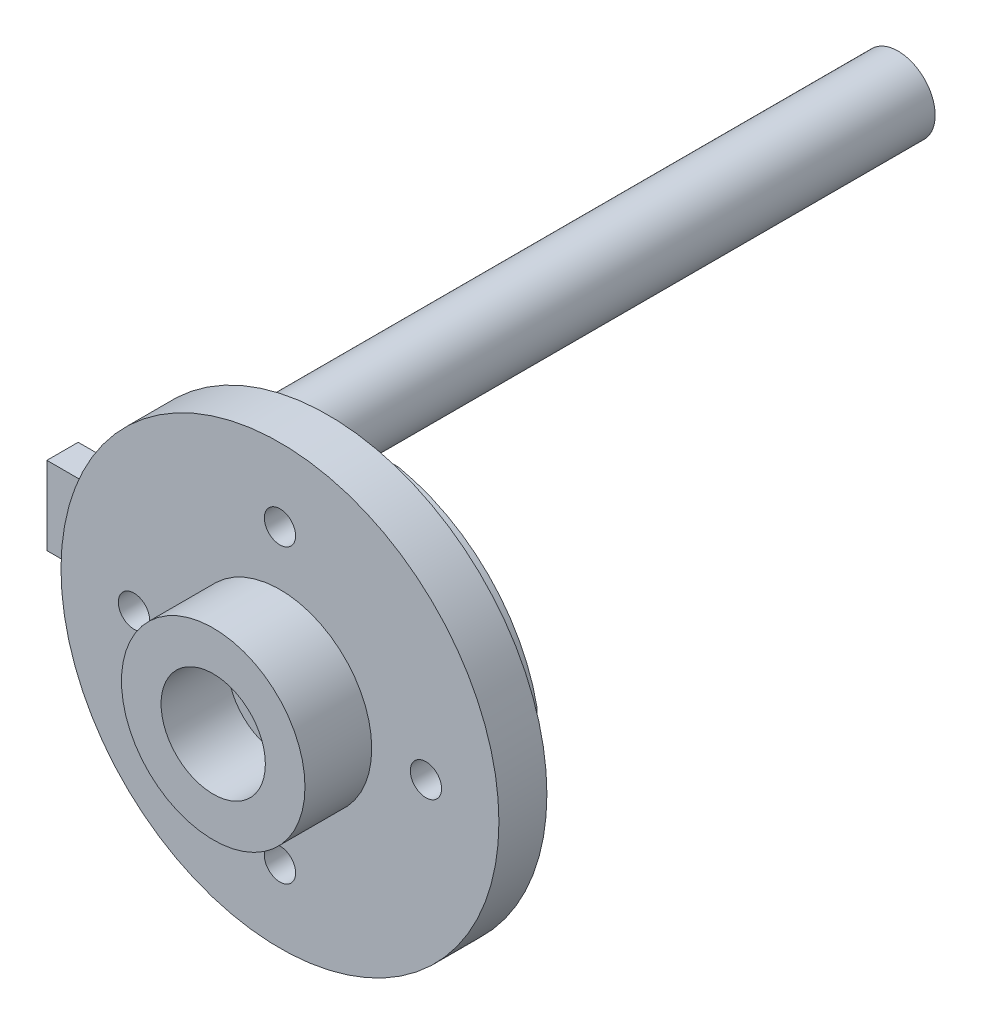
ISO-10303-21;
HEADER;
FILE_DESCRIPTION(('STEP AP214'),'2;1');
FILE_NAME('part.step','',(''),(''),'','','');
FILE_SCHEMA(('AUTOMOTIVE_DESIGN { 1 0 10303 214 1 1 1 1 }'));
ENDSEC;
DATA;
#1=APPLICATION_CONTEXT('core data for automotive mechanical design processes');
#2=APPLICATION_PROTOCOL_DEFINITION('international standard','automotive_design',2000,#1);
#3=PRODUCT_CONTEXT('',#1,'mechanical');
#4=PRODUCT('Part','Part','',(#3));
#5=PRODUCT_RELATED_PRODUCT_CATEGORY('part','',(#4));
#6=PRODUCT_DEFINITION_FORMATION('','',#4);
#7=PRODUCT_DEFINITION_CONTEXT('part definition',#1,'design');
#8=PRODUCT_DEFINITION('design','',#6,#7);
#9=PRODUCT_DEFINITION_SHAPE('','',#8);
#10=(LENGTH_UNIT() NAMED_UNIT(*) SI_UNIT(.MILLI.,.METRE.));
#11=(NAMED_UNIT(*) PLANE_ANGLE_UNIT() SI_UNIT($,.RADIAN.));
#12=(NAMED_UNIT(*) SI_UNIT($,.STERADIAN.) SOLID_ANGLE_UNIT());
#13=UNCERTAINTY_MEASURE_WITH_UNIT(LENGTH_MEASURE(1.E-05),#10,'distance_accuracy_value','');
#14=(GEOMETRIC_REPRESENTATION_CONTEXT(3) GLOBAL_UNCERTAINTY_ASSIGNED_CONTEXT((#13)) GLOBAL_UNIT_ASSIGNED_CONTEXT((#10,
#11,#12)) REPRESENTATION_CONTEXT('',''));
#15=CARTESIAN_POINT('',(0.,0.,0.));
#16=DIRECTION('',(0.,0.,1.));
#17=DIRECTION('',(1.,0.,0.));
#18=AXIS2_PLACEMENT_3D('',#15,#16,#17);
#19=CARTESIAN_POINT('',(0.,0.,0.));
#20=DIRECTION('',(0.,0.,1.));
#21=DIRECTION('',(1.,0.,0.));
#22=AXIS2_PLACEMENT_3D('',#19,#20,#21);
#23=PLANE('',#22);
#24=DIRECTION('',(-1.,0.,0.));
#25=VECTOR('',#24,1.);
#26=CARTESIAN_POINT('',(0.,8.5241,0.));
#27=LINE('',#26,#25);
#28=CARTESIAN_POINT('',(1.875,8.5241,0.));
#29=VERTEX_POINT('',#28);
#30=CARTESIAN_POINT('',(-1.875,8.5241,0.));
#31=VERTEX_POINT('',#30);
#32=EDGE_CURVE('E58',#29,#31,#27,.T.);
#33=ORIENTED_EDGE('',*,*,#32,.T.);
#34=CARTESIAN_POINT('',(-0.171875815797131,0.171875815797131,0.));
#35=DIRECTION('',(0.,0.,-1.));
#36=DIRECTION('',(-1.,0.,0.));
#37=AXIS2_PLACEMENT_3D('',#34,#35,#36);
#38=CIRCLE('',#37,8.5241);
#39=CARTESIAN_POINT('',(-8.5241,1.875,0.));
#40=VERTEX_POINT('',#39);
#41=EDGE_CURVE('E172',#31,#40,#38,.F.);
#42=ORIENTED_EDGE('',*,*,#41,.T.);
#43=DIRECTION('',(-1.,0.,0.));
#44=VECTOR('',#43,1.);
#45=CARTESIAN_POINT('',(0.,1.875,0.));
#46=LINE('',#45,#44);
#47=CARTESIAN_POINT('',(-10.3312329854669,1.875,0.));
#48=VERTEX_POINT('',#47);
#49=EDGE_CURVE('E147',#40,#48,#46,.T.);
#50=ORIENTED_EDGE('',*,*,#49,.T.);
#51=CARTESIAN_POINT('',(0.,0.,0.));
#52=DIRECTION('',(0.,0.,1.));
#53=DIRECTION('',(1.,0.,0.));
#54=AXIS2_PLACEMENT_3D('',#51,#52,#53);
#55=CIRCLE('',#54,10.5);
#56=CARTESIAN_POINT('',(-10.3312329854669,-1.875,0.));
#57=VERTEX_POINT('',#56);
#58=EDGE_CURVE('E300',#57,#48,#55,.T.);
#59=ORIENTED_EDGE('',*,*,#58,.F.);
#60=DIRECTION('',(-1.,0.,0.));
#61=VECTOR('',#60,1.);
#62=CARTESIAN_POINT('',(0.,-1.875,0.));
#63=LINE('',#62,#61);
#64=CARTESIAN_POINT('',(-8.5241,-1.875,0.));
#65=VERTEX_POINT('',#64);
#66=EDGE_CURVE('E222',#65,#57,#63,.T.);
#67=ORIENTED_EDGE('',*,*,#66,.F.);
#68=CARTESIAN_POINT('',(-0.171875815797131,-0.171875815797131,0.));
#69=DIRECTION('',(0.,0.,-1.));
#70=DIRECTION('',(-1.,0.,0.));
#71=AXIS2_PLACEMENT_3D('',#68,#69,#70);
#72=CIRCLE('',#71,8.5241);
#73=CARTESIAN_POINT('',(-1.875,-8.5241,0.));
#74=VERTEX_POINT('',#73);
#75=EDGE_CURVE('E185',#65,#74,#72,.F.);
#76=ORIENTED_EDGE('',*,*,#75,.T.);
#77=DIRECTION('',(-1.,0.,0.));
#78=VECTOR('',#77,1.);
#79=CARTESIAN_POINT('',(0.,-8.5241,0.));
#80=LINE('',#79,#78);
#81=CARTESIAN_POINT('',(1.875,-8.5241,0.));
#82=VERTEX_POINT('',#81);
#83=EDGE_CURVE('E200',#82,#74,#80,.T.);
#84=ORIENTED_EDGE('',*,*,#83,.F.);
#85=CARTESIAN_POINT('',(0.171932036922245,-0.171864351795491,0.));
#86=DIRECTION('',(0.,0.,-1.));
#87=DIRECTION('',(-1.,0.,0.));
#88=AXIS2_PLACEMENT_3D('',#85,#86,#87);
#89=CIRCLE('',#88,8.5241);
#90=CARTESIAN_POINT('',(8.52415388346195,-1.875,0.));
#91=VERTEX_POINT('',#90);
#92=EDGE_CURVE('E151',#82,#91,#89,.F.);
#93=ORIENTED_EDGE('',*,*,#92,.T.);
#94=DIRECTION('',(0.,-1.,0.));
#95=VECTOR('',#94,1.);
#96=CARTESIAN_POINT('',(8.52415388346195,0.,0.));
#97=LINE('',#96,#95);
#98=CARTESIAN_POINT('',(8.52415388346195,1.875,0.));
#99=VERTEX_POINT('',#98);
#100=EDGE_CURVE('E249',#99,#91,#97,.T.);
#101=ORIENTED_EDGE('',*,*,#100,.F.);
#102=CARTESIAN_POINT('',(0.171932036922245,0.171864351795491,0.));
#103=DIRECTION('',(0.,0.,-1.));
#104=DIRECTION('',(-1.,0.,0.));
#105=AXIS2_PLACEMENT_3D('',#102,#103,#104);
#106=CIRCLE('',#105,8.5241);
#107=EDGE_CURVE('E63',#29,#99,#106,.T.);
#108=ORIENTED_EDGE('',*,*,#107,.F.);
#109=EDGE_LOOP('',(#33,#42,#50,#59,#67,#76,#84,#93,#101,#108));
#110=FACE_BOUND('',#109,.T.);
#111=ADVANCED_FACE('F41',(#110),#23,.F.);
#112=CARTESIAN_POINT('',(0.,0.,2.3));
#113=DIRECTION('',(0.,0.,1.));
#114=DIRECTION('',(1.,0.,0.));
#115=AXIS2_PLACEMENT_3D('',#112,#113,#114);
#116=PLANE('',#115);
#117=CARTESIAN_POINT('',(0.,0.,2.3));
#118=DIRECTION('',(0.,0.,1.));
#119=DIRECTION('',(1.,0.,0.));
#120=AXIS2_PLACEMENT_3D('',#117,#118,#119);
#121=CIRCLE('',#120,1.5);
#122=CARTESIAN_POINT('',(1.5,0.,2.3));
#123=VERTEX_POINT('',#122);
#124=EDGE_CURVE('E285',#123,#123,#121,.T.);
#125=ORIENTED_EDGE('',*,*,#124,.F.);
#126=EDGE_LOOP('',(#125));
#127=FACE_BOUND('',#126,.T.);
#128=CARTESIAN_POINT('',(0.,0.,2.3));
#129=DIRECTION('',(0.,0.,1.));
#130=DIRECTION('',(1.,0.,0.));
#131=AXIS2_PLACEMENT_3D('',#128,#129,#130);
#132=CIRCLE('',#131,2.5);
#133=CARTESIAN_POINT('',(2.5,0.,2.3));
#134=VERTEX_POINT('',#133);
#135=EDGE_CURVE('E45',#134,#134,#132,.F.);
#136=ORIENTED_EDGE('',*,*,#135,.F.);
#137=EDGE_LOOP('',(#136));
#138=FACE_BOUND('',#137,.T.);
#139=ADVANCED_FACE('F339',(#127,#138),#116,.T.);
#140=CARTESIAN_POINT('',(0.,0.,2.3));
#141=DIRECTION('',(0.,0.,-1.));
#142=DIRECTION('',(-1.,0.,0.));
#143=AXIS2_PLACEMENT_3D('',#140,#141,#142);
#144=CYLINDRICAL_SURFACE('',#143,10.5);
#145=CARTESIAN_POINT('',(0.,0.,2.3));
#146=DIRECTION('',(0.,0.,1.));
#147=DIRECTION('',(1.,0.,0.));
#148=AXIS2_PLACEMENT_3D('',#145,#146,#147);
#149=CIRCLE('',#148,10.5);
#150=CARTESIAN_POINT('',(10.5,0.,2.3));
#151=VERTEX_POINT('',#150);
#152=EDGE_CURVE('E301',#151,#151,#149,.T.);
#153=ORIENTED_EDGE('',*,*,#152,.F.);
#154=EDGE_LOOP('',(#153));
#155=FACE_BOUND('',#154,.T.);
#156=EDGE_CURVE('E304',#48,#57,#55,.T.);
#157=ORIENTED_EDGE('',*,*,#156,.T.);
#158=ORIENTED_EDGE('',*,*,#58,.T.);
#159=EDGE_LOOP('',(#157,#158));
#160=FACE_BOUND('',#159,.T.);
#161=ADVANCED_FACE('F43',(#155,#160),#144,.T.);
#162=CARTESIAN_POINT('',(0.,0.,2.3));
#163=DIRECTION('',(0.,0.,1.));
#164=DIRECTION('',(1.,0.,0.));
#165=AXIS2_PLACEMENT_3D('',#162,#163,#164);
#166=CIRCLE('',#165,4.4);
#167=CARTESIAN_POINT('',(4.4,0.,2.3));
#168=VERTEX_POINT('',#167);
#169=EDGE_CURVE('E272',#168,#168,#166,.T.);
#170=ORIENTED_EDGE('',*,*,#169,.F.);
#171=EDGE_LOOP('',(#170));
#172=FACE_BOUND('',#171,.T.);
#173=CARTESIAN_POINT('',(-7.,0.,2.3));
#174=DIRECTION('',(0.,0.,1.));
#175=DIRECTION('',(0.,1.,0.));
#176=AXIS2_PLACEMENT_3D('',#173,#174,#175);
#177=CIRCLE('',#176,0.75);
#178=CARTESIAN_POINT('',(-7.,0.749999999999976,2.3));
#179=VERTEX_POINT('',#178);
#180=EDGE_CURVE('E281',#179,#179,#177,.T.);
#181=ORIENTED_EDGE('',*,*,#180,.F.);
#182=EDGE_LOOP('',(#181));
#183=FACE_BOUND('',#182,.T.);
#184=CARTESIAN_POINT('',(0.,-7.,2.3));
#185=DIRECTION('',(0.,0.,1.));
#186=DIRECTION('',(-1.,0.,0.));
#187=AXIS2_PLACEMENT_3D('',#184,#185,#186);
#188=CIRCLE('',#187,0.75);
#189=CARTESIAN_POINT('',(-0.75,-7.,2.3));
#190=VERTEX_POINT('',#189);
#191=EDGE_CURVE('E286',#190,#190,#188,.T.);
#192=ORIENTED_EDGE('',*,*,#191,.F.);
#193=EDGE_LOOP('',(#192));
#194=FACE_BOUND('',#193,.T.);
#195=CARTESIAN_POINT('',(7.,0.,2.3));
#196=DIRECTION('',(0.,0.,1.));
#197=DIRECTION('',(0.,-1.,0.));
#198=AXIS2_PLACEMENT_3D('',#195,#196,#197);
#199=CIRCLE('',#198,0.75);
#200=CARTESIAN_POINT('',(7.00000000000001,-0.749999999999927,2.3));
#201=VERTEX_POINT('',#200);
#202=EDGE_CURVE('E277',#201,#201,#199,.T.);
#203=ORIENTED_EDGE('',*,*,#202,.F.);
#204=EDGE_LOOP('',(#203));
#205=FACE_BOUND('',#204,.T.);
#206=CARTESIAN_POINT('',(0.,7.,2.3));
#207=DIRECTION('',(0.,0.,1.));
#208=DIRECTION('',(1.,0.,0.));
#209=AXIS2_PLACEMENT_3D('',#206,#207,#208);
#210=CIRCLE('',#209,0.75);
#211=CARTESIAN_POINT('',(0.75,7.,2.3));
#212=VERTEX_POINT('',#211);
#213=EDGE_CURVE('E296',#212,#212,#210,.T.);
#214=ORIENTED_EDGE('',*,*,#213,.F.);
#215=EDGE_LOOP('',(#214));
#216=FACE_BOUND('',#215,.T.);
#217=ORIENTED_EDGE('',*,*,#152,.T.);
#218=EDGE_LOOP('',(#217));
#219=FACE_BOUND('',#218,.T.);
#220=ADVANCED_FACE('F347',(#172,#183,#194,#205,#216,#219),#116,.T.);
#221=CARTESIAN_POINT('',(0.,7.,0.));
#222=DIRECTION('',(0.,0.,1.));
#223=DIRECTION('',(1.,0.,0.));
#224=AXIS2_PLACEMENT_3D('',#221,#222,#223);
#225=CYLINDRICAL_SURFACE('',#224,0.75);
#226=ORIENTED_EDGE('',*,*,#213,.T.);
#227=EDGE_LOOP('',(#226));
#228=FACE_BOUND('',#227,.T.);
#229=CARTESIAN_POINT('',(0.,7.,-1.5));
#230=DIRECTION('',(0.,0.,-1.));
#231=DIRECTION('',(-1.,0.,0.));
#232=AXIS2_PLACEMENT_3D('',#229,#230,#231);
#233=CIRCLE('',#232,0.75);
#234=CARTESIAN_POINT('',(-0.75,7.,-1.5));
#235=VERTEX_POINT('',#234);
#236=EDGE_CURVE('E167',#235,#235,#233,.F.);
#237=ORIENTED_EDGE('',*,*,#236,.F.);
#238=EDGE_LOOP('',(#237));
#239=FACE_BOUND('',#238,.T.);
#240=ADVANCED_FACE('F350',(#228,#239),#225,.F.);
#241=CARTESIAN_POINT('',(0.,0.,0.));
#242=DIRECTION('',(0.,0.,1.));
#243=DIRECTION('',(1.,0.,0.));
#244=AXIS2_PLACEMENT_3D('',#241,#242,#243);
#245=CYLINDRICAL_SURFACE('',#244,1.5);
#246=ORIENTED_EDGE('',*,*,#124,.T.);
#247=EDGE_LOOP('',(#246));
#248=FACE_BOUND('',#247,.T.);
#249=CARTESIAN_POINT('',(0.,0.,-1.5));
#250=DIRECTION('',(0.,0.,-1.));
#251=DIRECTION('',(-1.,0.,0.));
#252=AXIS2_PLACEMENT_3D('',#249,#250,#251);
#253=CIRCLE('',#252,1.5);
#254=CARTESIAN_POINT('',(-1.5,0.,-1.5));
#255=VERTEX_POINT('',#254);
#256=EDGE_CURVE('E238',#255,#255,#253,.F.);
#257=ORIENTED_EDGE('',*,*,#256,.F.);
#258=EDGE_LOOP('',(#257));
#259=FACE_BOUND('',#258,.T.);
#260=ADVANCED_FACE('F354',(#248,#259),#245,.F.);
#261=CARTESIAN_POINT('',(7.,0.,0.));
#262=DIRECTION('',(0.,0.,1.));
#263=DIRECTION('',(1.,0.,0.));
#264=AXIS2_PLACEMENT_3D('',#261,#262,#263);
#265=CYLINDRICAL_SURFACE('',#264,0.75);
#266=ORIENTED_EDGE('',*,*,#202,.T.);
#267=EDGE_LOOP('',(#266));
#268=FACE_BOUND('',#267,.T.);
#269=CARTESIAN_POINT('',(7.,0.,-1.5));
#270=DIRECTION('',(0.,0.,-1.));
#271=DIRECTION('',(-1.,0.,0.));
#272=AXIS2_PLACEMENT_3D('',#269,#270,#271);
#273=CIRCLE('',#272,0.75);
#274=CARTESIAN_POINT('',(6.25,0.,-1.5));
#275=VERTEX_POINT('',#274);
#276=EDGE_CURVE('E234',#275,#275,#273,.F.);
#277=ORIENTED_EDGE('',*,*,#276,.F.);
#278=EDGE_LOOP('',(#277));
#279=FACE_BOUND('',#278,.T.);
#280=ADVANCED_FACE('F358',(#268,#279),#265,.F.);
#281=CARTESIAN_POINT('',(0.,-7.,0.));
#282=DIRECTION('',(0.,0.,1.));
#283=DIRECTION('',(1.,0.,0.));
#284=AXIS2_PLACEMENT_3D('',#281,#282,#283);
#285=CYLINDRICAL_SURFACE('',#284,0.75);
#286=ORIENTED_EDGE('',*,*,#191,.T.);
#287=EDGE_LOOP('',(#286));
#288=FACE_BOUND('',#287,.T.);
#289=CARTESIAN_POINT('',(0.,-7.,-1.5));
#290=DIRECTION('',(0.,0.,-1.));
#291=DIRECTION('',(-1.,0.,0.));
#292=AXIS2_PLACEMENT_3D('',#289,#290,#291);
#293=CIRCLE('',#292,0.75);
#294=CARTESIAN_POINT('',(-0.75,-7.,-1.5));
#295=VERTEX_POINT('',#294);
#296=EDGE_CURVE('E192',#295,#295,#293,.F.);
#297=ORIENTED_EDGE('',*,*,#296,.F.);
#298=EDGE_LOOP('',(#297));
#299=FACE_BOUND('',#298,.T.);
#300=ADVANCED_FACE('F362',(#288,#299),#285,.F.);
#301=CARTESIAN_POINT('',(-7.,0.,0.));
#302=DIRECTION('',(0.,0.,1.));
#303=DIRECTION('',(1.,0.,0.));
#304=AXIS2_PLACEMENT_3D('',#301,#302,#303);
#305=CYLINDRICAL_SURFACE('',#304,0.75);
#306=ORIENTED_EDGE('',*,*,#180,.T.);
#307=EDGE_LOOP('',(#306));
#308=FACE_BOUND('',#307,.T.);
#309=CARTESIAN_POINT('',(-7.,0.,-1.5));
#310=DIRECTION('',(0.,0.,-1.));
#311=DIRECTION('',(-1.,0.,0.));
#312=AXIS2_PLACEMENT_3D('',#309,#310,#311);
#313=CIRCLE('',#312,0.75);
#314=CARTESIAN_POINT('',(-7.75,0.,-1.5));
#315=VERTEX_POINT('',#314);
#316=EDGE_CURVE('E230',#315,#315,#313,.F.);
#317=ORIENTED_EDGE('',*,*,#316,.F.);
#318=EDGE_LOOP('',(#317));
#319=FACE_BOUND('',#318,.T.);
#320=ADVANCED_FACE('F366',(#308,#319),#305,.F.);
#321=CARTESIAN_POINT('',(0.,0.,5.5));
#322=DIRECTION('',(0.,0.,1.));
#323=DIRECTION('',(1.,0.,0.));
#324=AXIS2_PLACEMENT_3D('',#321,#322,#323);
#325=PLANE('',#324);
#326=CARTESIAN_POINT('',(0.,0.,5.5));
#327=DIRECTION('',(0.,0.,1.));
#328=DIRECTION('',(1.,0.,0.));
#329=AXIS2_PLACEMENT_3D('',#326,#327,#328);
#330=CIRCLE('',#329,4.4);
#331=CARTESIAN_POINT('',(4.4,0.,5.5));
#332=VERTEX_POINT('',#331);
#333=EDGE_CURVE('E273',#332,#332,#330,.T.);
#334=ORIENTED_EDGE('',*,*,#333,.T.);
#335=EDGE_LOOP('',(#334));
#336=FACE_BOUND('',#335,.T.);
#337=CARTESIAN_POINT('',(0.,0.,5.5));
#338=DIRECTION('',(0.,0.,1.));
#339=DIRECTION('',(1.,0.,0.));
#340=AXIS2_PLACEMENT_3D('',#337,#338,#339);
#341=CIRCLE('',#340,2.5);
#342=CARTESIAN_POINT('',(2.5,0.,5.5));
#343=VERTEX_POINT('',#342);
#344=EDGE_CURVE('E268',#343,#343,#341,.T.);
#345=ORIENTED_EDGE('',*,*,#344,.F.);
#346=EDGE_LOOP('',(#345));
#347=FACE_BOUND('',#346,.T.);
#348=ADVANCED_FACE('F369',(#336,#347),#325,.T.);
#349=CARTESIAN_POINT('',(0.,0.,5.5));
#350=DIRECTION('',(0.,0.,-1.));
#351=DIRECTION('',(-1.,0.,0.));
#352=AXIS2_PLACEMENT_3D('',#349,#350,#351);
#353=CYLINDRICAL_SURFACE('',#352,4.4);
#354=ORIENTED_EDGE('',*,*,#333,.F.);
#355=EDGE_LOOP('',(#354));
#356=FACE_BOUND('',#355,.T.);
#357=ORIENTED_EDGE('',*,*,#169,.T.);
#358=EDGE_LOOP('',(#357));
#359=FACE_BOUND('',#358,.T.);
#360=ADVANCED_FACE('F335',(#356,#359),#353,.T.);
#361=CARTESIAN_POINT('',(0.,0.,5.5));
#362=DIRECTION('',(0.,0.,-1.));
#363=DIRECTION('',(-1.,0.,0.));
#364=AXIS2_PLACEMENT_3D('',#361,#362,#363);
#365=CYLINDRICAL_SURFACE('',#364,2.5);
#366=ORIENTED_EDGE('',*,*,#344,.T.);
#367=EDGE_LOOP('',(#366));
#368=FACE_BOUND('',#367,.T.);
#369=ORIENTED_EDGE('',*,*,#135,.T.);
#370=EDGE_LOOP('',(#369));
#371=FACE_BOUND('',#370,.T.);
#372=ADVANCED_FACE('F326',(#368,#371),#365,.F.);
#373=CARTESIAN_POINT('',(-13.4758461165381,0.,-1.5));
#374=DIRECTION('',(-1.,0.,0.));
#375=DIRECTION('',(0.,0.,1.));
#376=AXIS2_PLACEMENT_3D('',#373,#374,#375);
#377=PLANE('',#376);
#378=DIRECTION('',(0.,-1.,0.));
#379=VECTOR('',#378,1.);
#380=CARTESIAN_POINT('',(-13.4758461165381,0.,0.));
#381=LINE('',#380,#379);
#382=CARTESIAN_POINT('',(-13.4758461165381,1.875,0.));
#383=VERTEX_POINT('',#382);
#384=CARTESIAN_POINT('',(-13.4758461165381,-1.875,0.));
#385=VERTEX_POINT('',#384);
#386=EDGE_CURVE('E219',#383,#385,#381,.T.);
#387=ORIENTED_EDGE('',*,*,#386,.F.);
#388=DIRECTION('',(0.,0.,1.));
#389=VECTOR('',#388,1.);
#390=CARTESIAN_POINT('',(-13.4758461165381,1.875,-1.5));
#391=LINE('',#390,#389);
#392=CARTESIAN_POINT('',(-13.4758461165381,1.875,-1.5));
#393=VERTEX_POINT('',#392);
#394=EDGE_CURVE('E265',#393,#383,#391,.T.);
#395=ORIENTED_EDGE('',*,*,#394,.F.);
#396=DIRECTION('',(0.,-1.,0.));
#397=VECTOR('',#396,1.);
#398=CARTESIAN_POINT('',(-13.4758461165381,0.,-1.5));
#399=LINE('',#398,#397);
#400=CARTESIAN_POINT('',(-13.4758461165381,-1.875,-1.5));
#401=VERTEX_POINT('',#400);
#402=EDGE_CURVE('E135',#393,#401,#399,.T.);
#403=ORIENTED_EDGE('',*,*,#402,.T.);
#404=DIRECTION('',(0.,0.,1.));
#405=VECTOR('',#404,1.);
#406=CARTESIAN_POINT('',(-13.4758461165381,-1.875,-1.5));
#407=LINE('',#406,#405);
#408=EDGE_CURVE('E242',#401,#385,#407,.T.);
#409=ORIENTED_EDGE('',*,*,#408,.T.);
#410=EDGE_LOOP('',(#387,#395,#403,#409));
#411=FACE_BOUND('',#410,.T.);
#412=ADVANCED_FACE('F324',(#411),#377,.T.);
#413=CARTESIAN_POINT('',(0.,1.875,-1.5));
#414=DIRECTION('',(0.,1.,0.));
#415=DIRECTION('',(0.,0.,1.));
#416=AXIS2_PLACEMENT_3D('',#413,#414,#415);
#417=PLANE('',#416);
#418=DIRECTION('',(0.,0.,1.));
#419=VECTOR('',#418,1.);
#420=CARTESIAN_POINT('',(-8.5241,1.875,-1.5));
#421=LINE('',#420,#419);
#422=CARTESIAN_POINT('',(-8.5241,1.875,-1.5));
#423=VERTEX_POINT('',#422);
#424=EDGE_CURVE('E144',#423,#40,#421,.T.);
#425=ORIENTED_EDGE('',*,*,#424,.F.);
#426=DIRECTION('',(-1.,0.,0.));
#427=VECTOR('',#426,1.);
#428=CARTESIAN_POINT('',(0.,1.875,-1.5));
#429=LINE('',#428,#427);
#430=EDGE_CURVE('E126',#423,#393,#429,.T.);
#431=ORIENTED_EDGE('',*,*,#430,.T.);
#432=ORIENTED_EDGE('',*,*,#394,.T.);
#433=EDGE_CURVE('E246',#48,#383,#46,.T.);
#434=ORIENTED_EDGE('',*,*,#433,.F.);
#435=ORIENTED_EDGE('',*,*,#49,.F.);
#436=EDGE_LOOP('',(#425,#431,#432,#434,#435));
#437=FACE_BOUND('',#436,.T.);
#438=ADVANCED_FACE('F145',(#437),#417,.T.);
#439=CARTESIAN_POINT('',(8.52415388346195,0.,-1.5));
#440=DIRECTION('',(-1.,0.,0.));
#441=DIRECTION('',(0.,0.,1.));
#442=AXIS2_PLACEMENT_3D('',#439,#440,#441);
#443=PLANE('',#442);
#444=ORIENTED_EDGE('',*,*,#100,.T.);
#445=DIRECTION('',(0.,0.,1.));
#446=VECTOR('',#445,1.);
#447=CARTESIAN_POINT('',(8.52415388346195,-1.875,-1.5));
#448=LINE('',#447,#446);
#449=CARTESIAN_POINT('',(8.52415388346195,-1.875,-1.5));
#450=VERTEX_POINT('',#449);
#451=EDGE_CURVE('E259',#450,#91,#448,.T.);
#452=ORIENTED_EDGE('',*,*,#451,.F.);
#453=DIRECTION('',(0.,-1.,0.));
#454=VECTOR('',#453,1.);
#455=CARTESIAN_POINT('',(8.52415388346195,0.,-1.5));
#456=LINE('',#455,#454);
#457=CARTESIAN_POINT('',(8.52415388346195,1.875,-1.5));
#458=VERTEX_POINT('',#457);
#459=EDGE_CURVE('E140',#458,#450,#456,.T.);
#460=ORIENTED_EDGE('',*,*,#459,.F.);
#461=DIRECTION('',(0.,0.,1.));
#462=VECTOR('',#461,1.);
#463=CARTESIAN_POINT('',(8.52415388346195,1.875,-1.5));
#464=LINE('',#463,#462);
#465=EDGE_CURVE('E262',#458,#99,#464,.T.);
#466=ORIENTED_EDGE('',*,*,#465,.T.);
#467=EDGE_LOOP('',(#444,#452,#460,#466));
#468=FACE_BOUND('',#467,.T.);
#469=ADVANCED_FACE('F332',(#468),#443,.F.);
#470=CARTESIAN_POINT('',(0.,-1.875,-1.5));
#471=DIRECTION('',(0.,1.,0.));
#472=DIRECTION('',(0.,0.,1.));
#473=AXIS2_PLACEMENT_3D('',#470,#471,#472);
#474=PLANE('',#473);
#475=DIRECTION('',(-1.,0.,0.));
#476=VECTOR('',#475,1.);
#477=CARTESIAN_POINT('',(0.,-1.875,-1.5));
#478=LINE('',#477,#476);
#479=CARTESIAN_POINT('',(-8.5241,-1.875,-1.5));
#480=VERTEX_POINT('',#479);
#481=EDGE_CURVE('E227',#480,#401,#478,.T.);
#482=ORIENTED_EDGE('',*,*,#481,.F.);
#483=DIRECTION('',(0.,0.,1.));
#484=VECTOR('',#483,1.);
#485=CARTESIAN_POINT('',(-8.5241,-1.875,-1.5));
#486=LINE('',#485,#484);
#487=EDGE_CURVE('E196',#480,#65,#486,.T.);
#488=ORIENTED_EDGE('',*,*,#487,.T.);
#489=ORIENTED_EDGE('',*,*,#66,.T.);
#490=EDGE_CURVE('E253',#57,#385,#63,.T.);
#491=ORIENTED_EDGE('',*,*,#490,.T.);
#492=ORIENTED_EDGE('',*,*,#408,.F.);
#493=EDGE_LOOP('',(#482,#488,#489,#491,#492));
#494=FACE_BOUND('',#493,.T.);
#495=ADVANCED_FACE('F322',(#494),#474,.F.);
#496=CARTESIAN_POINT('',(0.,0.,-1.5));
#497=DIRECTION('',(0.,0.,-1.));
#498=DIRECTION('',(-1.,0.,0.));
#499=AXIS2_PLACEMENT_3D('',#496,#497,#498);
#500=PLANE('',#499);
#501=CARTESIAN_POINT('',(-10.16,0.,-1.5));
#502=DIRECTION('',(0.,0.,-1.));
#503=DIRECTION('',(-1.,0.,0.));
#504=AXIS2_PLACEMENT_3D('',#501,#502,#503);
#505=CIRCLE('',#504,1.778);
#506=CARTESIAN_POINT('',(-11.938,0.,-1.5));
#507=VERTEX_POINT('',#506);
#508=EDGE_CURVE('E11',#507,#507,#505,.T.);
#509=ORIENTED_EDGE('',*,*,#508,.F.);
#510=EDGE_LOOP('',(#509));
#511=FACE_BOUND('',#510,.T.);
#512=ORIENTED_EDGE('',*,*,#402,.F.);
#513=ORIENTED_EDGE('',*,*,#430,.F.);
#514=CARTESIAN_POINT('',(-0.171875815797131,0.171875815797131,-1.5));
#515=DIRECTION('',(0.,0.,-1.));
#516=DIRECTION('',(-1.,0.,0.));
#517=AXIS2_PLACEMENT_3D('',#514,#515,#516);
#518=CIRCLE('',#517,8.5241);
#519=CARTESIAN_POINT('',(-1.875,8.5241,-1.5));
#520=VERTEX_POINT('',#519);
#521=EDGE_CURVE('E132',#520,#423,#518,.F.);
#522=ORIENTED_EDGE('',*,*,#521,.F.);
#523=DIRECTION('',(-1.,0.,0.));
#524=VECTOR('',#523,1.);
#525=CARTESIAN_POINT('',(0.,8.5241,-1.5));
#526=LINE('',#525,#524);
#527=CARTESIAN_POINT('',(1.875,8.5241,-1.5));
#528=VERTEX_POINT('',#527);
#529=EDGE_CURVE('E156',#528,#520,#526,.T.);
#530=ORIENTED_EDGE('',*,*,#529,.F.);
#531=CARTESIAN_POINT('',(0.171932036922245,0.171864351795491,-1.5));
#532=DIRECTION('',(0.,0.,-1.));
#533=DIRECTION('',(-1.,0.,0.));
#534=AXIS2_PLACEMENT_3D('',#531,#532,#533);
#535=CIRCLE('',#534,8.5241);
#536=EDGE_CURVE('E160',#528,#458,#535,.T.);
#537=ORIENTED_EDGE('',*,*,#536,.T.);
#538=ORIENTED_EDGE('',*,*,#459,.T.);
#539=CARTESIAN_POINT('',(0.171932036922245,-0.171864351795491,-1.5));
#540=DIRECTION('',(0.,0.,-1.));
#541=DIRECTION('',(-1.,0.,0.));
#542=AXIS2_PLACEMENT_3D('',#539,#540,#541);
#543=CIRCLE('',#542,8.5241);
#544=CARTESIAN_POINT('',(1.875,-8.5241,-1.5));
#545=VERTEX_POINT('',#544);
#546=EDGE_CURVE('E181',#545,#450,#543,.F.);
#547=ORIENTED_EDGE('',*,*,#546,.F.);
#548=DIRECTION('',(-1.,0.,0.));
#549=VECTOR('',#548,1.);
#550=CARTESIAN_POINT('',(0.,-8.5241,-1.5));
#551=LINE('',#550,#549);
#552=CARTESIAN_POINT('',(-1.875,-8.5241,-1.5));
#553=VERTEX_POINT('',#552);
#554=EDGE_CURVE('E184',#545,#553,#551,.T.);
#555=ORIENTED_EDGE('',*,*,#554,.T.);
#556=CARTESIAN_POINT('',(-0.171875815797131,-0.171875815797131,-1.5));
#557=DIRECTION('',(0.,0.,-1.));
#558=DIRECTION('',(-1.,0.,0.));
#559=AXIS2_PLACEMENT_3D('',#556,#557,#558);
#560=CIRCLE('',#559,8.5241);
#561=EDGE_CURVE('E188',#480,#553,#560,.F.);
#562=ORIENTED_EDGE('',*,*,#561,.F.);
#563=ORIENTED_EDGE('',*,*,#481,.T.);
#564=EDGE_LOOP('',(#512,#513,#522,#530,#537,#538,#547,#555,#562,#563));
#565=FACE_BOUND('',#564,.T.);
#566=ORIENTED_EDGE('',*,*,#316,.T.);
#567=EDGE_LOOP('',(#566));
#568=FACE_BOUND('',#567,.T.);
#569=ORIENTED_EDGE('',*,*,#276,.T.);
#570=EDGE_LOOP('',(#569));
#571=FACE_BOUND('',#570,.T.);
#572=ORIENTED_EDGE('',*,*,#256,.T.);
#573=EDGE_LOOP('',(#572));
#574=FACE_BOUND('',#573,.T.);
#575=ORIENTED_EDGE('',*,*,#296,.T.);
#576=EDGE_LOOP('',(#575));
#577=FACE_BOUND('',#576,.T.);
#578=ORIENTED_EDGE('',*,*,#236,.T.);
#579=EDGE_LOOP('',(#578));
#580=FACE_BOUND('',#579,.T.);
#581=ADVANCED_FACE('F128',(#511,#565,#568,#571,#574,#577,#580),#500,.T.);
#582=CARTESIAN_POINT('',(0.,0.,0.));
#583=DIRECTION('',(0.,0.,-1.));
#584=DIRECTION('',(-1.,0.,0.));
#585=AXIS2_PLACEMENT_3D('',#582,#583,#584);
#586=PLANE('',#585);
#587=ORIENTED_EDGE('',*,*,#156,.F.);
#588=ORIENTED_EDGE('',*,*,#433,.T.);
#589=ORIENTED_EDGE('',*,*,#386,.T.);
#590=ORIENTED_EDGE('',*,*,#490,.F.);
#591=EDGE_LOOP('',(#587,#588,#589,#590));
#592=FACE_BOUND('',#591,.T.);
#593=ADVANCED_FACE('F317',(#592),#586,.F.);
#594=CARTESIAN_POINT('',(-10.16,0.,-37.5));
#595=DIRECTION('',(0.,0.,1.));
#596=DIRECTION('',(1.,0.,0.));
#597=AXIS2_PLACEMENT_3D('',#594,#595,#596);
#598=CYLINDRICAL_SURFACE('',#597,1.778);
#599=CARTESIAN_POINT('',(-10.16,0.,-37.5));
#600=DIRECTION('',(0.,0.,-1.));
#601=DIRECTION('',(-1.,0.,0.));
#602=AXIS2_PLACEMENT_3D('',#599,#600,#601);
#603=CIRCLE('',#602,1.778);
#604=CARTESIAN_POINT('',(-11.938,0.,-37.5));
#605=VERTEX_POINT('',#604);
#606=EDGE_CURVE('E216',#605,#605,#603,.T.);
#607=ORIENTED_EDGE('',*,*,#606,.F.);
#608=EDGE_LOOP('',(#607));
#609=FACE_BOUND('',#608,.T.);
#610=ORIENTED_EDGE('',*,*,#508,.T.);
#611=EDGE_LOOP('',(#610));
#612=FACE_BOUND('',#611,.T.);
#613=ADVANCED_FACE('F439',(#609,#612),#598,.T.);
#614=CARTESIAN_POINT('',(-10.16,0.,-37.5));
#615=DIRECTION('',(0.,0.,-1.));
#616=DIRECTION('',(-1.,0.,0.));
#617=AXIS2_PLACEMENT_3D('',#614,#615,#616);
#618=PLANE('',#617);
#619=ORIENTED_EDGE('',*,*,#606,.T.);
#620=EDGE_LOOP('',(#619));
#621=FACE_BOUND('',#620,.T.);
#622=ADVANCED_FACE('F449',(#621),#618,.T.);
#623=CARTESIAN_POINT('',(0.171932036922245,-0.171864351795491,-1.5));
#624=DIRECTION('',(0.,0.,1.));
#625=DIRECTION('',(1.,0.,0.));
#626=AXIS2_PLACEMENT_3D('',#623,#624,#625);
#627=CYLINDRICAL_SURFACE('',#626,8.5241);
#628=ORIENTED_EDGE('',*,*,#92,.F.);
#629=DIRECTION('',(0.,0.,1.));
#630=VECTOR('',#629,1.);
#631=CARTESIAN_POINT('',(1.875,-8.5241,-1.5));
#632=LINE('',#631,#630);
#633=EDGE_CURVE('E213',#545,#82,#632,.T.);
#634=ORIENTED_EDGE('',*,*,#633,.F.);
#635=ORIENTED_EDGE('',*,*,#546,.T.);
#636=ORIENTED_EDGE('',*,*,#451,.T.);
#637=EDGE_LOOP('',(#628,#634,#635,#636));
#638=FACE_BOUND('',#637,.T.);
#639=ADVANCED_FACE('F458',(#638),#627,.T.);
#640=CARTESIAN_POINT('',(0.,-8.5241,-1.5));
#641=DIRECTION('',(0.,1.,0.));
#642=DIRECTION('',(0.,0.,1.));
#643=AXIS2_PLACEMENT_3D('',#640,#641,#642);
#644=PLANE('',#643);
#645=ORIENTED_EDGE('',*,*,#83,.T.);
#646=DIRECTION('',(0.,0.,1.));
#647=VECTOR('',#646,1.);
#648=CARTESIAN_POINT('',(-1.875,-8.5241,-1.5));
#649=LINE('',#648,#647);
#650=EDGE_CURVE('E210',#553,#74,#649,.T.);
#651=ORIENTED_EDGE('',*,*,#650,.F.);
#652=ORIENTED_EDGE('',*,*,#554,.F.);
#653=ORIENTED_EDGE('',*,*,#633,.T.);
#654=EDGE_LOOP('',(#645,#651,#652,#653));
#655=FACE_BOUND('',#654,.T.);
#656=ADVANCED_FACE('F469',(#655),#644,.F.);
#657=CARTESIAN_POINT('',(-0.171875815797131,-0.171875815797131,-1.5));
#658=DIRECTION('',(0.,0.,1.));
#659=DIRECTION('',(1.,0.,0.));
#660=AXIS2_PLACEMENT_3D('',#657,#658,#659);
#661=CYLINDRICAL_SURFACE('',#660,8.5241);
#662=ORIENTED_EDGE('',*,*,#75,.F.);
#663=ORIENTED_EDGE('',*,*,#487,.F.);
#664=ORIENTED_EDGE('',*,*,#561,.T.);
#665=ORIENTED_EDGE('',*,*,#650,.T.);
#666=EDGE_LOOP('',(#662,#663,#664,#665));
#667=FACE_BOUND('',#666,.T.);
#668=ADVANCED_FACE('F478',(#667),#661,.T.);
#669=CARTESIAN_POINT('',(-0.171875815797131,0.171875815797131,-1.5));
#670=DIRECTION('',(0.,0.,1.));
#671=DIRECTION('',(1.,0.,0.));
#672=AXIS2_PLACEMENT_3D('',#669,#670,#671);
#673=CYLINDRICAL_SURFACE('',#672,8.5241);
#674=ORIENTED_EDGE('',*,*,#41,.F.);
#675=DIRECTION('',(0.,0.,1.));
#676=VECTOR('',#675,1.);
#677=CARTESIAN_POINT('',(-1.875,8.5241,-1.5));
#678=LINE('',#677,#676);
#679=EDGE_CURVE('E152',#520,#31,#678,.T.);
#680=ORIENTED_EDGE('',*,*,#679,.F.);
#681=ORIENTED_EDGE('',*,*,#521,.T.);
#682=ORIENTED_EDGE('',*,*,#424,.T.);
#683=EDGE_LOOP('',(#674,#680,#681,#682));
#684=FACE_BOUND('',#683,.T.);
#685=ADVANCED_FACE('F154',(#684),#673,.T.);
#686=CARTESIAN_POINT('',(0.,8.5241,-1.5));
#687=DIRECTION('',(0.,1.,0.));
#688=DIRECTION('',(0.,0.,1.));
#689=AXIS2_PLACEMENT_3D('',#686,#687,#688);
#690=PLANE('',#689);
#691=ORIENTED_EDGE('',*,*,#32,.F.);
#692=DIRECTION('',(0.,0.,1.));
#693=VECTOR('',#692,1.);
#694=CARTESIAN_POINT('',(1.875,8.5241,-1.5));
#695=LINE('',#694,#693);
#696=EDGE_CURVE('E171',#528,#29,#695,.T.);
#697=ORIENTED_EDGE('',*,*,#696,.F.);
#698=ORIENTED_EDGE('',*,*,#529,.T.);
#699=ORIENTED_EDGE('',*,*,#679,.T.);
#700=EDGE_LOOP('',(#691,#697,#698,#699));
#701=FACE_BOUND('',#700,.T.);
#702=ADVANCED_FACE('F493',(#701),#690,.T.);
#703=CARTESIAN_POINT('',(0.171932036922245,0.171864351795491,-1.5));
#704=DIRECTION('',(0.,0.,1.));
#705=DIRECTION('',(1.,0.,0.));
#706=AXIS2_PLACEMENT_3D('',#703,#704,#705);
#707=CYLINDRICAL_SURFACE('',#706,8.5241);
#708=ORIENTED_EDGE('',*,*,#107,.T.);
#709=ORIENTED_EDGE('',*,*,#465,.F.);
#710=ORIENTED_EDGE('',*,*,#536,.F.);
#711=ORIENTED_EDGE('',*,*,#696,.T.);
#712=EDGE_LOOP('',(#708,#709,#710,#711));
#713=FACE_BOUND('',#712,.T.);
#714=ADVANCED_FACE('F500',(#713),#707,.T.);
#715=CLOSED_SHELL('',(#111,#139,#161,#220,#240,#260,#280,#300,#320,#348,#360,#372,#412,#438,
#469,#495,#581,#593,#613,#622,#639,#656,#668,#685,#702,#714));
#716=MANIFOLD_SOLID_BREP('B2',#715);
#717=ADVANCED_BREP_SHAPE_REPRESENTATION('',(#18,#716),#14);
#718=SHAPE_DEFINITION_REPRESENTATION(#9,#717);
ENDSEC;
END-ISO-10303-21;
